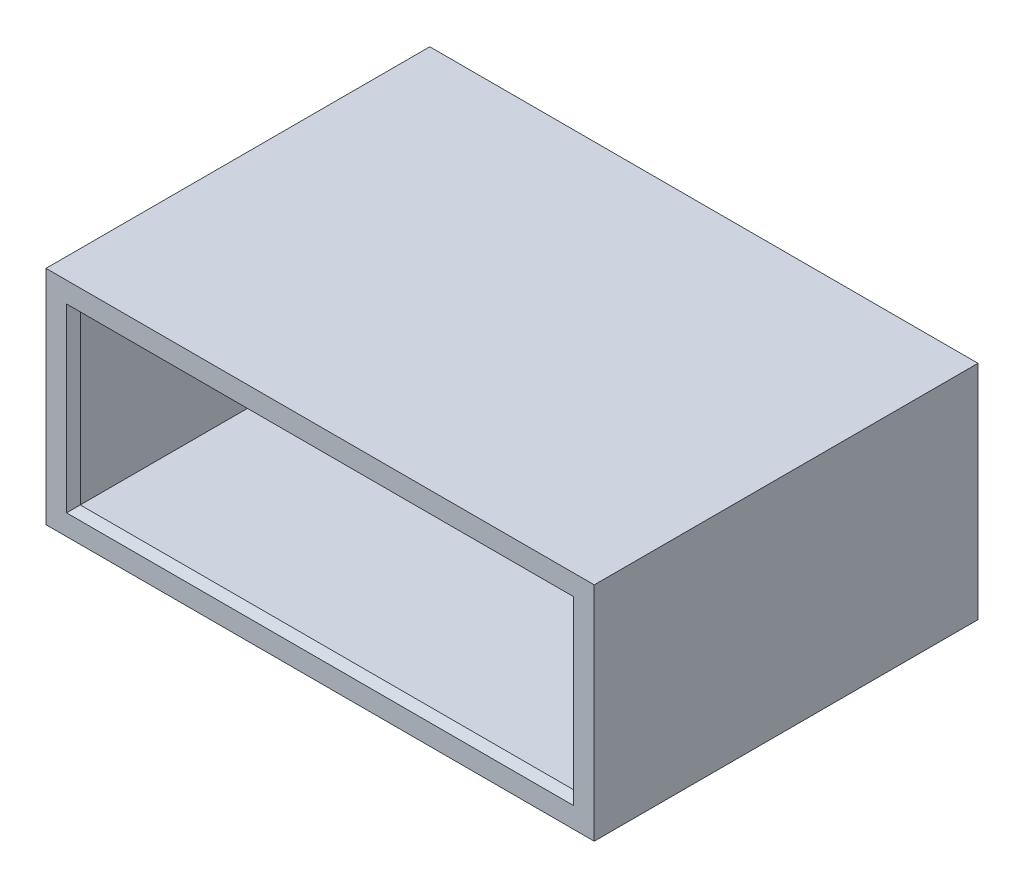
ISO-10303-21;
HEADER;
FILE_DESCRIPTION(('STEP AP214'),'2;1');
FILE_NAME('part.step','',(''),(''),'','','');
FILE_SCHEMA(('AUTOMOTIVE_DESIGN { 1 0 10303 214 1 1 1 1 }'));
ENDSEC;
DATA;
#1=APPLICATION_CONTEXT('core data for automotive mechanical design processes');
#2=APPLICATION_PROTOCOL_DEFINITION('international standard','automotive_design',2000,#1);
#3=PRODUCT_CONTEXT('',#1,'mechanical');
#4=PRODUCT('Part','Part','',(#3));
#5=PRODUCT_RELATED_PRODUCT_CATEGORY('part','',(#4));
#6=PRODUCT_DEFINITION_FORMATION('','',#4);
#7=PRODUCT_DEFINITION_CONTEXT('part definition',#1,'design');
#8=PRODUCT_DEFINITION('design','',#6,#7);
#9=PRODUCT_DEFINITION_SHAPE('','',#8);
#10=(LENGTH_UNIT() NAMED_UNIT(*) SI_UNIT(.MILLI.,.METRE.));
#11=(NAMED_UNIT(*) PLANE_ANGLE_UNIT() SI_UNIT($,.RADIAN.));
#12=(NAMED_UNIT(*) SI_UNIT($,.STERADIAN.) SOLID_ANGLE_UNIT());
#13=UNCERTAINTY_MEASURE_WITH_UNIT(LENGTH_MEASURE(1.E-05),#10,'distance_accuracy_value','');
#14=(GEOMETRIC_REPRESENTATION_CONTEXT(3) GLOBAL_UNCERTAINTY_ASSIGNED_CONTEXT((#13)) GLOBAL_UNIT_ASSIGNED_CONTEXT((#10,
#11,#12)) REPRESENTATION_CONTEXT('',''));
#15=CARTESIAN_POINT('',(0.,0.,0.));
#16=DIRECTION('',(0.,0.,1.));
#17=DIRECTION('',(1.,0.,0.));
#18=AXIS2_PLACEMENT_3D('',#15,#16,#17);
#19=CARTESIAN_POINT('',(0.,0.,14.));
#20=DIRECTION('',(0.,0.,-1.));
#21=DIRECTION('',(-1.,0.,0.));
#22=AXIS2_PLACEMENT_3D('',#19,#20,#21);
#23=PLANE('',#22);
#24=DIRECTION('',(0.,1.,0.));
#25=VECTOR('',#24,1.);
#26=CARTESIAN_POINT('',(-9.25,3.05,14.));
#27=LINE('',#26,#25);
#28=CARTESIAN_POINT('',(-9.25,-3.3,14.));
#29=VERTEX_POINT('',#28);
#30=CARTESIAN_POINT('',(-9.25,3.3,14.));
#31=VERTEX_POINT('',#30);
#32=EDGE_CURVE('E166',#29,#31,#27,.T.);
#33=ORIENTED_EDGE('',*,*,#32,.T.);
#34=DIRECTION('',(1.,0.,0.));
#35=VECTOR('',#34,1.);
#36=CARTESIAN_POINT('',(9.,3.3,14.));
#37=LINE('',#36,#35);
#38=CARTESIAN_POINT('',(9.25,3.3,14.));
#39=VERTEX_POINT('',#38);
#40=EDGE_CURVE('E174',#31,#39,#37,.T.);
#41=ORIENTED_EDGE('',*,*,#40,.T.);
#42=DIRECTION('',(0.,-1.,0.));
#43=VECTOR('',#42,1.);
#44=CARTESIAN_POINT('',(9.25,-3.05,14.));
#45=LINE('',#44,#43);
#46=CARTESIAN_POINT('',(9.25,-3.3,14.));
#47=VERTEX_POINT('',#46);
#48=EDGE_CURVE('E164',#39,#47,#45,.T.);
#49=ORIENTED_EDGE('',*,*,#48,.T.);
#50=DIRECTION('',(-1.,0.,0.));
#51=VECTOR('',#50,1.);
#52=CARTESIAN_POINT('',(-9.,-3.3,14.));
#53=LINE('',#52,#51);
#54=EDGE_CURVE('E170',#47,#29,#53,.T.);
#55=ORIENTED_EDGE('',*,*,#54,.T.);
#56=EDGE_LOOP('',(#33,#41,#49,#55));
#57=FACE_BOUND('',#56,.T.);
#58=DIRECTION('',(0.,1.,0.));
#59=VECTOR('',#58,1.);
#60=CARTESIAN_POINT('',(10.,-4.05,14.));
#61=LINE('',#60,#59);
#62=CARTESIAN_POINT('',(10.,-4.05,14.));
#63=VERTEX_POINT('',#62);
#64=CARTESIAN_POINT('',(10.,4.05,14.));
#65=VERTEX_POINT('',#64);
#66=EDGE_CURVE('E142',#63,#65,#61,.T.);
#67=ORIENTED_EDGE('',*,*,#66,.T.);
#68=DIRECTION('',(-1.,0.,0.));
#69=VECTOR('',#68,1.);
#70=CARTESIAN_POINT('',(-10.,4.05,14.));
#71=LINE('',#70,#69);
#72=CARTESIAN_POINT('',(-10.,4.05,14.));
#73=VERTEX_POINT('',#72);
#74=EDGE_CURVE('E134',#65,#73,#71,.T.);
#75=ORIENTED_EDGE('',*,*,#74,.T.);
#76=DIRECTION('',(0.,-1.,0.));
#77=VECTOR('',#76,1.);
#78=CARTESIAN_POINT('',(-10.,-4.05,14.));
#79=LINE('',#78,#77);
#80=CARTESIAN_POINT('',(-10.,-4.05,14.));
#81=VERTEX_POINT('',#80);
#82=EDGE_CURVE('E143',#73,#81,#79,.T.);
#83=ORIENTED_EDGE('',*,*,#82,.T.);
#84=DIRECTION('',(1.,0.,0.));
#85=VECTOR('',#84,1.);
#86=CARTESIAN_POINT('',(-10.,-4.05,14.));
#87=LINE('',#86,#85);
#88=EDGE_CURVE('E148',#81,#63,#87,.T.);
#89=ORIENTED_EDGE('',*,*,#88,.T.);
#90=EDGE_LOOP('',(#67,#75,#83,#89));
#91=FACE_BOUND('',#90,.T.);
#92=ADVANCED_FACE('F41',(#57,#91),#23,.F.);
#93=CARTESIAN_POINT('',(0.,0.,0.));
#94=DIRECTION('',(0.,0.,-1.));
#95=DIRECTION('',(-1.,0.,0.));
#96=AXIS2_PLACEMENT_3D('',#93,#94,#95);
#97=PLANE('',#96);
#98=DIRECTION('',(-1.,0.,0.));
#99=VECTOR('',#98,1.);
#100=CARTESIAN_POINT('',(0.,3.3,0.));
#101=LINE('',#100,#99);
#102=CARTESIAN_POINT('',(9.25,3.3,0.));
#103=VERTEX_POINT('',#102);
#104=CARTESIAN_POINT('',(-9.24999999999999,3.3,0.));
#105=VERTEX_POINT('',#104);
#106=EDGE_CURVE('E51',#103,#105,#101,.T.);
#107=ORIENTED_EDGE('',*,*,#106,.T.);
#108=DIRECTION('',(0.,-1.,0.));
#109=VECTOR('',#108,1.);
#110=CARTESIAN_POINT('',(-9.24999999999999,0.,0.));
#111=LINE('',#110,#109);
#112=CARTESIAN_POINT('',(-9.24999999999999,-3.3,0.));
#113=VERTEX_POINT('',#112);
#114=EDGE_CURVE('E11',#105,#113,#111,.T.);
#115=ORIENTED_EDGE('',*,*,#114,.T.);
#116=DIRECTION('',(1.,0.,0.));
#117=VECTOR('',#116,1.);
#118=CARTESIAN_POINT('',(0.,-3.3,0.));
#119=LINE('',#118,#117);
#120=CARTESIAN_POINT('',(9.25,-3.3,0.));
#121=VERTEX_POINT('',#120);
#122=EDGE_CURVE('E186',#113,#121,#119,.T.);
#123=ORIENTED_EDGE('',*,*,#122,.T.);
#124=DIRECTION('',(0.,1.,0.));
#125=VECTOR('',#124,1.);
#126=CARTESIAN_POINT('',(9.25,0.,0.));
#127=LINE('',#126,#125);
#128=EDGE_CURVE('E61',#121,#103,#127,.T.);
#129=ORIENTED_EDGE('',*,*,#128,.T.);
#130=EDGE_LOOP('',(#107,#115,#123,#129));
#131=FACE_BOUND('',#130,.T.);
#132=DIRECTION('',(0.,1.,0.));
#133=VECTOR('',#132,1.);
#134=CARTESIAN_POINT('',(10.,-4.05,0.));
#135=LINE('',#134,#133);
#136=CARTESIAN_POINT('',(10.,-4.05,0.));
#137=VERTEX_POINT('',#136);
#138=CARTESIAN_POINT('',(10.,4.05,0.));
#139=VERTEX_POINT('',#138);
#140=EDGE_CURVE('E152',#137,#139,#135,.T.);
#141=ORIENTED_EDGE('',*,*,#140,.F.);
#142=DIRECTION('',(1.,0.,0.));
#143=VECTOR('',#142,1.);
#144=CARTESIAN_POINT('',(-10.,-4.05,0.));
#145=LINE('',#144,#143);
#146=CARTESIAN_POINT('',(-10.,-4.05,0.));
#147=VERTEX_POINT('',#146);
#148=EDGE_CURVE('E147',#147,#137,#145,.T.);
#149=ORIENTED_EDGE('',*,*,#148,.F.);
#150=DIRECTION('',(0.,-1.,0.));
#151=VECTOR('',#150,1.);
#152=CARTESIAN_POINT('',(-10.,-4.05,0.));
#153=LINE('',#152,#151);
#154=CARTESIAN_POINT('',(-10.,4.05,0.));
#155=VERTEX_POINT('',#154);
#156=EDGE_CURVE('E243',#155,#147,#153,.T.);
#157=ORIENTED_EDGE('',*,*,#156,.F.);
#158=DIRECTION('',(-1.,0.,0.));
#159=VECTOR('',#158,1.);
#160=CARTESIAN_POINT('',(-10.,4.05,0.));
#161=LINE('',#160,#159);
#162=EDGE_CURVE('E241',#139,#155,#161,.T.);
#163=ORIENTED_EDGE('',*,*,#162,.F.);
#164=EDGE_LOOP('',(#141,#149,#157,#163));
#165=FACE_BOUND('',#164,.T.);
#166=ADVANCED_FACE('F254',(#131,#165),#97,.T.);
#167=CARTESIAN_POINT('',(10.,-4.05,14.));
#168=DIRECTION('',(-1.,0.,0.));
#169=DIRECTION('',(0.,0.,1.));
#170=AXIS2_PLACEMENT_3D('',#167,#168,#169);
#171=PLANE('',#170);
#172=ORIENTED_EDGE('',*,*,#140,.T.);
#173=DIRECTION('',(0.,0.,-1.));
#174=VECTOR('',#173,1.);
#175=CARTESIAN_POINT('',(10.,4.05,14.));
#176=LINE('',#175,#174);
#177=EDGE_CURVE('E132',#65,#139,#176,.T.);
#178=ORIENTED_EDGE('',*,*,#177,.F.);
#179=ORIENTED_EDGE('',*,*,#66,.F.);
#180=DIRECTION('',(0.,0.,-1.));
#181=VECTOR('',#180,1.);
#182=CARTESIAN_POINT('',(10.,-4.05,14.));
#183=LINE('',#182,#181);
#184=EDGE_CURVE('E238',#63,#137,#183,.T.);
#185=ORIENTED_EDGE('',*,*,#184,.T.);
#186=EDGE_LOOP('',(#172,#178,#179,#185));
#187=FACE_BOUND('',#186,.T.);
#188=ADVANCED_FACE('F155',(#187),#171,.F.);
#189=CARTESIAN_POINT('',(-10.,4.05,14.));
#190=DIRECTION('',(0.,-1.,0.));
#191=DIRECTION('',(0.,0.,-1.));
#192=AXIS2_PLACEMENT_3D('',#189,#190,#191);
#193=PLANE('',#192);
#194=ORIENTED_EDGE('',*,*,#162,.T.);
#195=DIRECTION('',(0.,0.,-1.));
#196=VECTOR('',#195,1.);
#197=CARTESIAN_POINT('',(-10.,4.05,14.));
#198=LINE('',#197,#196);
#199=EDGE_CURVE('E137',#73,#155,#198,.T.);
#200=ORIENTED_EDGE('',*,*,#199,.F.);
#201=ORIENTED_EDGE('',*,*,#74,.F.);
#202=ORIENTED_EDGE('',*,*,#177,.T.);
#203=EDGE_LOOP('',(#194,#200,#201,#202));
#204=FACE_BOUND('',#203,.T.);
#205=ADVANCED_FACE('F135',(#204),#193,.F.);
#206=CARTESIAN_POINT('',(-10.,-4.05,14.));
#207=DIRECTION('',(1.,0.,0.));
#208=DIRECTION('',(0.,0.,-1.));
#209=AXIS2_PLACEMENT_3D('',#206,#207,#208);
#210=PLANE('',#209);
#211=ORIENTED_EDGE('',*,*,#156,.T.);
#212=DIRECTION('',(0.,0.,-1.));
#213=VECTOR('',#212,1.);
#214=CARTESIAN_POINT('',(-10.,-4.05,14.));
#215=LINE('',#214,#213);
#216=EDGE_CURVE('E157',#81,#147,#215,.T.);
#217=ORIENTED_EDGE('',*,*,#216,.F.);
#218=ORIENTED_EDGE('',*,*,#82,.F.);
#219=ORIENTED_EDGE('',*,*,#199,.T.);
#220=EDGE_LOOP('',(#211,#217,#218,#219));
#221=FACE_BOUND('',#220,.T.);
#222=ADVANCED_FACE('F258',(#221),#210,.F.);
#223=CARTESIAN_POINT('',(-10.,-4.05,14.));
#224=DIRECTION('',(0.,1.,0.));
#225=DIRECTION('',(0.,0.,1.));
#226=AXIS2_PLACEMENT_3D('',#223,#224,#225);
#227=PLANE('',#226);
#228=ORIENTED_EDGE('',*,*,#148,.T.);
#229=ORIENTED_EDGE('',*,*,#184,.F.);
#230=ORIENTED_EDGE('',*,*,#88,.F.);
#231=ORIENTED_EDGE('',*,*,#216,.T.);
#232=EDGE_LOOP('',(#228,#229,#230,#231));
#233=FACE_BOUND('',#232,.T.);
#234=ADVANCED_FACE('F253',(#233),#227,.F.);
#235=CARTESIAN_POINT('',(9.,-3.05,14.));
#236=DIRECTION('',(-1.,0.,0.));
#237=DIRECTION('',(0.,0.,1.));
#238=AXIS2_PLACEMENT_3D('',#235,#236,#237);
#239=PLANE('',#238);
#240=DIRECTION('',(0.,0.,-1.));
#241=VECTOR('',#240,1.);
#242=CARTESIAN_POINT('',(9.,-3.05,14.));
#243=LINE('',#242,#241);
#244=CARTESIAN_POINT('',(9.,-3.05,13.75));
#245=VERTEX_POINT('',#244);
#246=CARTESIAN_POINT('',(9.,-3.05,0.25));
#247=VERTEX_POINT('',#246);
#248=EDGE_CURVE('E203',#245,#247,#243,.T.);
#249=ORIENTED_EDGE('',*,*,#248,.F.);
#250=DIRECTION('',(0.,1.,0.));
#251=VECTOR('',#250,1.);
#252=CARTESIAN_POINT('',(9.,3.05,13.75));
#253=LINE('',#252,#251);
#254=CARTESIAN_POINT('',(9.,3.05,13.75));
#255=VERTEX_POINT('',#254);
#256=EDGE_CURVE('E183',#245,#255,#253,.T.);
#257=ORIENTED_EDGE('',*,*,#256,.T.);
#258=DIRECTION('',(0.,0.,-1.));
#259=VECTOR('',#258,1.);
#260=CARTESIAN_POINT('',(9.,3.05,14.));
#261=LINE('',#260,#259);
#262=CARTESIAN_POINT('',(9.,3.05,0.25));
#263=VERTEX_POINT('',#262);
#264=EDGE_CURVE('E221',#255,#263,#261,.T.);
#265=ORIENTED_EDGE('',*,*,#264,.T.);
#266=DIRECTION('',(0.,-1.,0.));
#267=VECTOR('',#266,1.);
#268=CARTESIAN_POINT('',(9.,-3.05,0.25));
#269=LINE('',#268,#267);
#270=EDGE_CURVE('E181',#263,#247,#269,.T.);
#271=ORIENTED_EDGE('',*,*,#270,.T.);
#272=EDGE_LOOP('',(#249,#257,#265,#271));
#273=FACE_BOUND('',#272,.T.);
#274=ADVANCED_FACE('F222',(#273),#239,.T.);
#275=CARTESIAN_POINT('',(-9.,3.05,14.));
#276=DIRECTION('',(0.,-1.,0.));
#277=DIRECTION('',(0.,0.,-1.));
#278=AXIS2_PLACEMENT_3D('',#275,#276,#277);
#279=PLANE('',#278);
#280=ORIENTED_EDGE('',*,*,#264,.F.);
#281=DIRECTION('',(-1.,0.,0.));
#282=VECTOR('',#281,1.);
#283=CARTESIAN_POINT('',(-9.,3.05,13.75));
#284=LINE('',#283,#282);
#285=CARTESIAN_POINT('',(-9.,3.05,13.75));
#286=VERTEX_POINT('',#285);
#287=EDGE_CURVE('E160',#255,#286,#284,.T.);
#288=ORIENTED_EDGE('',*,*,#287,.T.);
#289=DIRECTION('',(0.,0.,-1.));
#290=VECTOR('',#289,1.);
#291=CARTESIAN_POINT('',(-9.,3.05,14.));
#292=LINE('',#291,#290);
#293=CARTESIAN_POINT('',(-9.,3.05,0.25));
#294=VERTEX_POINT('',#293);
#295=EDGE_CURVE('E234',#286,#294,#292,.T.);
#296=ORIENTED_EDGE('',*,*,#295,.T.);
#297=DIRECTION('',(1.,0.,0.));
#298=VECTOR('',#297,1.);
#299=CARTESIAN_POINT('',(-9.,3.05,0.25));
#300=LINE('',#299,#298);
#301=EDGE_CURVE('E154',#294,#263,#300,.T.);
#302=ORIENTED_EDGE('',*,*,#301,.T.);
#303=EDGE_LOOP('',(#280,#288,#296,#302));
#304=FACE_BOUND('',#303,.T.);
#305=ADVANCED_FACE('F274',(#304),#279,.T.);
#306=CARTESIAN_POINT('',(-9.,-3.05,14.));
#307=DIRECTION('',(1.,0.,0.));
#308=DIRECTION('',(0.,0.,-1.));
#309=AXIS2_PLACEMENT_3D('',#306,#307,#308);
#310=PLANE('',#309);
#311=ORIENTED_EDGE('',*,*,#295,.F.);
#312=DIRECTION('',(0.,-1.,0.));
#313=VECTOR('',#312,1.);
#314=CARTESIAN_POINT('',(-9.,-3.05,13.75));
#315=LINE('',#314,#313);
#316=CARTESIAN_POINT('',(-9.,-3.05,13.75));
#317=VERTEX_POINT('',#316);
#318=EDGE_CURVE('E179',#286,#317,#315,.T.);
#319=ORIENTED_EDGE('',*,*,#318,.T.);
#320=DIRECTION('',(0.,0.,-1.));
#321=VECTOR('',#320,1.);
#322=CARTESIAN_POINT('',(-9.,-3.05,14.));
#323=LINE('',#322,#321);
#324=CARTESIAN_POINT('',(-9.,-3.05,0.25));
#325=VERTEX_POINT('',#324);
#326=EDGE_CURVE('E227',#317,#325,#323,.T.);
#327=ORIENTED_EDGE('',*,*,#326,.T.);
#328=DIRECTION('',(0.,1.,0.));
#329=VECTOR('',#328,1.);
#330=CARTESIAN_POINT('',(-9.,-3.05,0.25));
#331=LINE('',#330,#329);
#332=EDGE_CURVE('E173',#325,#294,#331,.T.);
#333=ORIENTED_EDGE('',*,*,#332,.T.);
#334=EDGE_LOOP('',(#311,#319,#327,#333));
#335=FACE_BOUND('',#334,.T.);
#336=ADVANCED_FACE('F279',(#335),#310,.T.);
#337=CARTESIAN_POINT('',(-9.,-3.05,14.));
#338=DIRECTION('',(0.,1.,0.));
#339=DIRECTION('',(0.,0.,1.));
#340=AXIS2_PLACEMENT_3D('',#337,#338,#339);
#341=PLANE('',#340);
#342=ORIENTED_EDGE('',*,*,#326,.F.);
#343=DIRECTION('',(1.,0.,0.));
#344=VECTOR('',#343,1.);
#345=CARTESIAN_POINT('',(9.,-3.05,13.75));
#346=LINE('',#345,#344);
#347=EDGE_CURVE('E182',#317,#245,#346,.T.);
#348=ORIENTED_EDGE('',*,*,#347,.T.);
#349=ORIENTED_EDGE('',*,*,#248,.T.);
#350=DIRECTION('',(-1.,0.,0.));
#351=VECTOR('',#350,1.);
#352=CARTESIAN_POINT('',(-9.,-3.05,0.25));
#353=LINE('',#352,#351);
#354=EDGE_CURVE('E180',#247,#325,#353,.T.);
#355=ORIENTED_EDGE('',*,*,#354,.T.);
#356=EDGE_LOOP('',(#342,#348,#349,#355));
#357=FACE_BOUND('',#356,.T.);
#358=ADVANCED_FACE('F226',(#357),#341,.T.);
#359=CARTESIAN_POINT('',(-9.,-3.05,13.75));
#360=DIRECTION('',(0.,0.707106781186543,0.707106781186552));
#361=DIRECTION('',(-1.,0.,0.));
#362=AXIS2_PLACEMENT_3D('',#359,#360,#361);
#363=PLANE('',#362);
#364=DIRECTION('',(-0.577350269189628,-0.577350269189628,0.57735026918962));
#365=VECTOR('',#364,1.);
#366=CARTESIAN_POINT('',(-9.,-3.05,13.75));
#367=LINE('',#366,#365);
#368=EDGE_CURVE('E191',#29,#317,#367,.F.);
#369=ORIENTED_EDGE('',*,*,#368,.F.);
#370=ORIENTED_EDGE('',*,*,#54,.F.);
#371=DIRECTION('',(0.577350269189628,-0.577350269189628,0.57735026918962));
#372=VECTOR('',#371,1.);
#373=CARTESIAN_POINT('',(2.99999999999995,2.95000000000005,7.75000000000003));
#374=LINE('',#373,#372);
#375=EDGE_CURVE('E196',#245,#47,#374,.T.);
#376=ORIENTED_EDGE('',*,*,#375,.F.);
#377=ORIENTED_EDGE('',*,*,#347,.F.);
#378=EDGE_LOOP('',(#369,#370,#376,#377));
#379=FACE_BOUND('',#378,.T.);
#380=ADVANCED_FACE('F283',(#379),#363,.T.);
#381=CARTESIAN_POINT('',(9.,-3.05,13.75));
#382=DIRECTION('',(-0.707106781186543,0.,0.707106781186552));
#383=DIRECTION('',(0.,-1.,0.));
#384=AXIS2_PLACEMENT_3D('',#381,#382,#383);
#385=PLANE('',#384);
#386=ORIENTED_EDGE('',*,*,#375,.T.);
#387=ORIENTED_EDGE('',*,*,#48,.F.);
#388=DIRECTION('',(-0.577350269189628,-0.577350269189628,-0.57735026918962));
#389=VECTOR('',#388,1.);
#390=CARTESIAN_POINT('',(2.99999999999995,-2.95000000000006,7.75000000000003));
#391=LINE('',#390,#389);
#392=EDGE_CURVE('E192',#255,#39,#391,.F.);
#393=ORIENTED_EDGE('',*,*,#392,.F.);
#394=ORIENTED_EDGE('',*,*,#256,.F.);
#395=EDGE_LOOP('',(#386,#387,#393,#394));
#396=FACE_BOUND('',#395,.T.);
#397=ADVANCED_FACE('F287',(#396),#385,.T.);
#398=CARTESIAN_POINT('',(-9.,-3.05,13.75));
#399=DIRECTION('',(0.707106781186543,0.,0.707106781186552));
#400=DIRECTION('',(0.,1.,0.));
#401=AXIS2_PLACEMENT_3D('',#398,#399,#400);
#402=PLANE('',#401);
#403=ORIENTED_EDGE('',*,*,#368,.T.);
#404=ORIENTED_EDGE('',*,*,#318,.F.);
#405=DIRECTION('',(-0.577350269189628,0.577350269189628,0.57735026918962));
#406=VECTOR('',#405,1.);
#407=CARTESIAN_POINT('',(-9.,3.05,13.75));
#408=LINE('',#407,#406);
#409=EDGE_CURVE('E193',#31,#286,#408,.F.);
#410=ORIENTED_EDGE('',*,*,#409,.F.);
#411=ORIENTED_EDGE('',*,*,#32,.F.);
#412=EDGE_LOOP('',(#403,#404,#410,#411));
#413=FACE_BOUND('',#412,.T.);
#414=ADVANCED_FACE('F294',(#413),#402,.T.);
#415=CARTESIAN_POINT('',(-9.,3.05,13.75));
#416=DIRECTION('',(0.,-0.707106781186543,0.707106781186552));
#417=DIRECTION('',(1.,0.,0.));
#418=AXIS2_PLACEMENT_3D('',#415,#416,#417);
#419=PLANE('',#418);
#420=ORIENTED_EDGE('',*,*,#392,.T.);
#421=ORIENTED_EDGE('',*,*,#40,.F.);
#422=ORIENTED_EDGE('',*,*,#409,.T.);
#423=ORIENTED_EDGE('',*,*,#287,.F.);
#424=EDGE_LOOP('',(#420,#421,#422,#423));
#425=FACE_BOUND('',#424,.T.);
#426=ADVANCED_FACE('F323',(#425),#419,.T.);
#427=CARTESIAN_POINT('',(9.25,0.,0.));
#428=DIRECTION('',(0.707106781186552,0.,0.707106781186543));
#429=DIRECTION('',(0.,1.,0.));
#430=AXIS2_PLACEMENT_3D('',#427,#428,#429);
#431=PLANE('',#430);
#432=DIRECTION('',(0.577350269189623,-0.577350269189623,-0.577350269189631));
#433=VECTOR('',#432,1.);
#434=CARTESIAN_POINT('',(8.15000000000001,-2.20000000000001,1.1));
#435=LINE('',#434,#433);
#436=EDGE_CURVE('E202',#247,#121,#435,.T.);
#437=ORIENTED_EDGE('',*,*,#436,.F.);
#438=ORIENTED_EDGE('',*,*,#270,.F.);
#439=DIRECTION('',(0.577350269189623,0.577350269189623,-0.577350269189631));
#440=VECTOR('',#439,1.);
#441=CARTESIAN_POINT('',(6.16666666666669,0.216666666666691,3.08333333333335));
#442=LINE('',#441,#440);
#443=EDGE_CURVE('E46',#103,#263,#442,.F.);
#444=ORIENTED_EDGE('',*,*,#443,.F.);
#445=ORIENTED_EDGE('',*,*,#128,.F.);
#446=EDGE_LOOP('',(#437,#438,#444,#445));
#447=FACE_BOUND('',#446,.T.);
#448=ADVANCED_FACE('F42',(#447),#431,.F.);
#449=CARTESIAN_POINT('',(0.,3.3,0.));
#450=DIRECTION('',(0.,0.707106781186552,0.707106781186543));
#451=DIRECTION('',(-1.,0.,0.));
#452=AXIS2_PLACEMENT_3D('',#449,#450,#451);
#453=PLANE('',#452);
#454=ORIENTED_EDGE('',*,*,#443,.T.);
#455=ORIENTED_EDGE('',*,*,#301,.F.);
#456=DIRECTION('',(-0.577350269189623,0.577350269189623,-0.577350269189631));
#457=VECTOR('',#456,1.);
#458=CARTESIAN_POINT('',(-8.15000000000001,2.20000000000001,1.1));
#459=LINE('',#458,#457);
#460=EDGE_CURVE('E204',#105,#294,#459,.F.);
#461=ORIENTED_EDGE('',*,*,#460,.F.);
#462=ORIENTED_EDGE('',*,*,#106,.F.);
#463=EDGE_LOOP('',(#454,#455,#461,#462));
#464=FACE_BOUND('',#463,.T.);
#465=ADVANCED_FACE('F212',(#464),#453,.F.);
#466=CARTESIAN_POINT('',(0.,-3.3,0.));
#467=DIRECTION('',(0.,-0.707106781186552,0.707106781186543));
#468=DIRECTION('',(1.,0.,0.));
#469=AXIS2_PLACEMENT_3D('',#466,#467,#468);
#470=PLANE('',#469);
#471=ORIENTED_EDGE('',*,*,#436,.T.);
#472=ORIENTED_EDGE('',*,*,#122,.F.);
#473=DIRECTION('',(0.577350269189623,0.577350269189623,0.577350269189631));
#474=VECTOR('',#473,1.);
#475=CARTESIAN_POINT('',(-8.15,-2.20000000000001,1.1));
#476=LINE('',#475,#474);
#477=EDGE_CURVE('E205',#325,#113,#476,.F.);
#478=ORIENTED_EDGE('',*,*,#477,.F.);
#479=ORIENTED_EDGE('',*,*,#354,.F.);
#480=EDGE_LOOP('',(#471,#472,#478,#479));
#481=FACE_BOUND('',#480,.T.);
#482=ADVANCED_FACE('F313',(#481),#470,.F.);
#483=CARTESIAN_POINT('',(-9.24999999999999,0.,0.));
#484=DIRECTION('',(-0.707106781186552,0.,0.707106781186543));
#485=DIRECTION('',(0.,-1.,0.));
#486=AXIS2_PLACEMENT_3D('',#483,#484,#485);
#487=PLANE('',#486);
#488=ORIENTED_EDGE('',*,*,#460,.T.);
#489=ORIENTED_EDGE('',*,*,#332,.F.);
#490=ORIENTED_EDGE('',*,*,#477,.T.);
#491=ORIENTED_EDGE('',*,*,#114,.F.);
#492=EDGE_LOOP('',(#488,#489,#490,#491));
#493=FACE_BOUND('',#492,.T.);
#494=ADVANCED_FACE('F301',(#493),#487,.F.);
#495=CLOSED_SHELL('',(#92,#166,#188,#205,#222,#234,#274,#305,#336,#358,#380,#397,#414,#426,#448,
#465,#482,#494));
#496=MANIFOLD_SOLID_BREP('B2',#495);
#497=ADVANCED_BREP_SHAPE_REPRESENTATION('',(#18,#496),#14);
#498=SHAPE_DEFINITION_REPRESENTATION(#9,#497);
ENDSEC;
END-ISO-10303-21;
